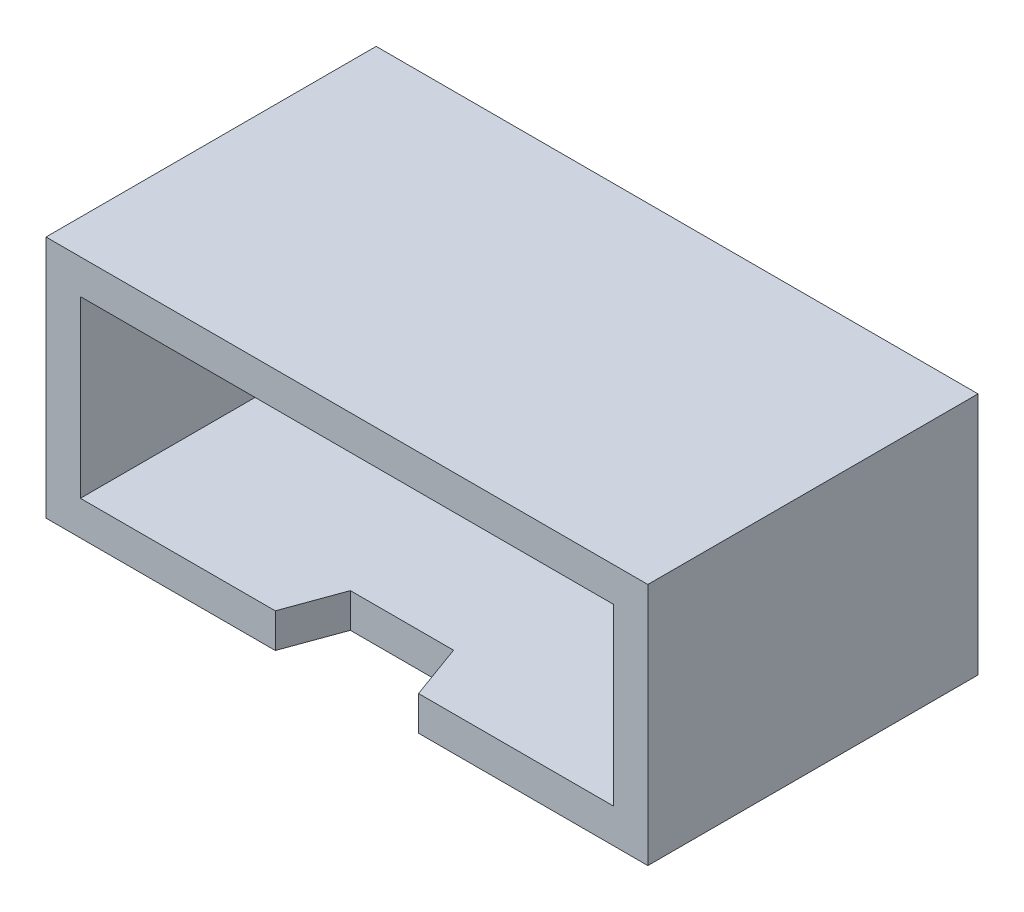
ISO-10303-21;
HEADER;
FILE_DESCRIPTION(('STEP AP214'),'2;1');
FILE_NAME('part.step','',(''),(''),'','','');
FILE_SCHEMA(('AUTOMOTIVE_DESIGN { 1 0 10303 214 1 1 1 1 }'));
ENDSEC;
DATA;
#1=APPLICATION_CONTEXT('core data for automotive mechanical design processes');
#2=APPLICATION_PROTOCOL_DEFINITION('international standard','automotive_design',2000,#1);
#3=PRODUCT_CONTEXT('',#1,'mechanical');
#4=PRODUCT('Part','Part','',(#3));
#5=PRODUCT_RELATED_PRODUCT_CATEGORY('part','',(#4));
#6=PRODUCT_DEFINITION_FORMATION('','',#4);
#7=PRODUCT_DEFINITION_CONTEXT('part definition',#1,'design');
#8=PRODUCT_DEFINITION('design','',#6,#7);
#9=PRODUCT_DEFINITION_SHAPE('','',#8);
#10=(LENGTH_UNIT() NAMED_UNIT(*) SI_UNIT(.MILLI.,.METRE.));
#11=(NAMED_UNIT(*) PLANE_ANGLE_UNIT() SI_UNIT($,.RADIAN.));
#12=(NAMED_UNIT(*) SI_UNIT($,.STERADIAN.) SOLID_ANGLE_UNIT());
#13=UNCERTAINTY_MEASURE_WITH_UNIT(LENGTH_MEASURE(1.E-05),#10,'distance_accuracy_value','');
#14=(GEOMETRIC_REPRESENTATION_CONTEXT(3) GLOBAL_UNCERTAINTY_ASSIGNED_CONTEXT((#13)) GLOBAL_UNIT_ASSIGNED_CONTEXT((#10,
#11,#12)) REPRESENTATION_CONTEXT('',''));
#15=CARTESIAN_POINT('',(0.,0.,0.));
#16=DIRECTION('',(0.,0.,1.));
#17=DIRECTION('',(1.,0.,0.));
#18=AXIS2_PLACEMENT_3D('',#15,#16,#17);
#19=CARTESIAN_POINT('',(7.98,-3.54,8.));
#20=DIRECTION('',(0.,0.,-1.));
#21=DIRECTION('',(-1.,0.,0.));
#22=AXIS2_PLACEMENT_3D('',#19,#20,#21);
#23=PLANE('',#22);
#24=DIRECTION('',(0.,1.,0.));
#25=VECTOR('',#24,1.);
#26=CARTESIAN_POINT('',(4.98,-3.54,8.));
#27=LINE('',#26,#25);
#28=CARTESIAN_POINT('',(4.98,-2.53999998509884,8.));
#29=VERTEX_POINT('',#28);
#30=CARTESIAN_POINT('',(4.98,-3.54,8.));
#31=VERTEX_POINT('',#30);
#32=EDGE_CURVE('E126',#29,#31,#27,.F.);
#33=ORIENTED_EDGE('',*,*,#32,.T.);
#34=DIRECTION('',(1.,0.,0.));
#35=VECTOR('',#34,1.);
#36=CARTESIAN_POINT('',(-2.27,-3.54,8.));
#37=LINE('',#36,#35);
#38=CARTESIAN_POINT('',(7.98,-3.54,8.));
#39=VERTEX_POINT('',#38);
#40=EDGE_CURVE('E136',#39,#31,#37,.F.);
#41=ORIENTED_EDGE('',*,*,#40,.F.);
#42=DIRECTION('',(0.,1.,0.));
#43=VECTOR('',#42,1.);
#44=CARTESIAN_POINT('',(7.98,-3.54,8.));
#45=LINE('',#44,#43);
#46=CARTESIAN_POINT('',(7.98,-2.53999998509884,8.));
#47=VERTEX_POINT('',#46);
#48=EDGE_CURVE('E19',#39,#47,#45,.T.);
#49=ORIENTED_EDGE('',*,*,#48,.T.);
#50=DIRECTION('',(1.,0.,0.));
#51=VECTOR('',#50,1.);
#52=CARTESIAN_POINT('',(14.2299999850988,-2.53999998509884,8.));
#53=LINE('',#52,#51);
#54=EDGE_CURVE('E133',#29,#47,#53,.T.);
#55=ORIENTED_EDGE('',*,*,#54,.F.);
#56=EDGE_LOOP('',(#33,#41,#49,#55));
#57=FACE_BOUND('',#56,.T.);
#58=ADVANCED_FACE('F16',(#57),#23,.F.);
#59=CARTESIAN_POINT('',(8.56235237482626,-3.54,9.6));
#60=DIRECTION('',(0.939692620785844,0.,-0.342020143325846));
#61=DIRECTION('',(-0.342020143325846,0.,-0.939692620785844));
#62=AXIS2_PLACEMENT_3D('',#59,#60,#61);
#63=PLANE('',#62);
#64=ORIENTED_EDGE('',*,*,#48,.F.);
#65=DIRECTION('',(-0.342020143325842,0.,-0.939692620785845));
#66=VECTOR('',#65,1.);
#67=CARTESIAN_POINT('',(8.56235237482626,-3.54,9.6));
#68=LINE('',#67,#66);
#69=CARTESIAN_POINT('',(8.56235237482626,-3.54,9.6));
#70=VERTEX_POINT('',#69);
#71=EDGE_CURVE('E156',#70,#39,#68,.T.);
#72=ORIENTED_EDGE('',*,*,#71,.F.);
#73=DIRECTION('',(0.,1.,0.));
#74=VECTOR('',#73,1.);
#75=CARTESIAN_POINT('',(8.56235237482626,0.,9.6));
#76=LINE('',#75,#74);
#77=CARTESIAN_POINT('',(8.56235237482626,-2.53999998509884,9.6));
#78=VERTEX_POINT('',#77);
#79=EDGE_CURVE('E144',#78,#70,#76,.F.);
#80=ORIENTED_EDGE('',*,*,#79,.F.);
#81=DIRECTION('',(0.342020143325843,0.,0.939692620785845));
#82=VECTOR('',#81,1.);
#83=CARTESIAN_POINT('',(7.98,-2.53999998509884,8.));
#84=LINE('',#83,#82);
#85=EDGE_CURVE('E141',#47,#78,#84,.T.);
#86=ORIENTED_EDGE('',*,*,#85,.F.);
#87=EDGE_LOOP('',(#64,#72,#80,#86));
#88=FACE_BOUND('',#87,.T.);
#89=ADVANCED_FACE('F142',(#88),#63,.F.);
#90=CARTESIAN_POINT('',(4.98,-3.54,8.));
#91=DIRECTION('',(-0.939692620785775,0.,-0.342020143326035));
#92=DIRECTION('',(-0.342020143326035,0.,0.939692620785775));
#93=AXIS2_PLACEMENT_3D('',#90,#91,#92);
#94=PLANE('',#93);
#95=DIRECTION('',(0.,1.,0.));
#96=VECTOR('',#95,1.);
#97=CARTESIAN_POINT('',(4.39764762517337,0.,9.6));
#98=LINE('',#97,#96);
#99=CARTESIAN_POINT('',(4.39764762517337,-3.54,9.6));
#100=VERTEX_POINT('',#99);
#101=CARTESIAN_POINT('',(4.39764762517337,-2.53999998509884,9.6));
#102=VERTEX_POINT('',#101);
#103=EDGE_CURVE('E182',#100,#102,#98,.T.);
#104=ORIENTED_EDGE('',*,*,#103,.F.);
#105=DIRECTION('',(-0.342020143326035,0.,0.939692620785775));
#106=VECTOR('',#105,1.);
#107=CARTESIAN_POINT('',(4.98,-3.54,8.));
#108=LINE('',#107,#106);
#109=EDGE_CURVE('E179',#31,#100,#108,.T.);
#110=ORIENTED_EDGE('',*,*,#109,.F.);
#111=ORIENTED_EDGE('',*,*,#32,.F.);
#112=DIRECTION('',(0.342020143326036,0.,-0.939692620785775));
#113=VECTOR('',#112,1.);
#114=CARTESIAN_POINT('',(4.39764762517337,-2.53999998509884,9.6));
#115=LINE('',#114,#113);
#116=EDGE_CURVE('E154',#102,#29,#115,.T.);
#117=ORIENTED_EDGE('',*,*,#116,.F.);
#118=EDGE_LOOP('',(#104,#110,#111,#117));
#119=FACE_BOUND('',#118,.T.);
#120=ADVANCED_FACE('F180',(#119),#94,.F.);
#121=CARTESIAN_POINT('',(-1.26999998509884,-2.53999998509884,0.));
#122=DIRECTION('',(1.,0.,0.));
#123=DIRECTION('',(0.,1.,0.));
#124=AXIS2_PLACEMENT_3D('',#121,#122,#123);
#125=PLANE('',#124);
#126=DIRECTION('',(0.,1.,0.));
#127=VECTOR('',#126,1.);
#128=CARTESIAN_POINT('',(-1.26999998509884,0.,9.6));
#129=LINE('',#128,#127);
#130=CARTESIAN_POINT('',(-1.26999998509884,-2.53999998509884,9.6));
#131=VERTEX_POINT('',#130);
#132=CARTESIAN_POINT('',(-1.26999998509884,2.53999998509884,9.6));
#133=VERTEX_POINT('',#132);
#134=EDGE_CURVE('E234',#131,#133,#129,.T.);
#135=ORIENTED_EDGE('',*,*,#134,.F.);
#136=DIRECTION('',(0.,0.,1.));
#137=VECTOR('',#136,1.);
#138=CARTESIAN_POINT('',(-1.26999998509884,-2.53999998509884,0.));
#139=LINE('',#138,#137);
#140=CARTESIAN_POINT('',(-1.26999998509884,-2.53999998509884,0.));
#141=VERTEX_POINT('',#140);
#142=EDGE_CURVE('E162',#141,#131,#139,.T.);
#143=ORIENTED_EDGE('',*,*,#142,.F.);
#144=DIRECTION('',(0.,1.,0.));
#145=VECTOR('',#144,1.);
#146=CARTESIAN_POINT('',(-1.26999998509884,0.,0.));
#147=LINE('',#146,#145);
#148=CARTESIAN_POINT('',(-1.26999998509884,2.53999998509884,0.));
#149=VERTEX_POINT('',#148);
#150=EDGE_CURVE('E203',#141,#149,#147,.T.);
#151=ORIENTED_EDGE('',*,*,#150,.T.);
#152=DIRECTION('',(0.,0.,-1.));
#153=VECTOR('',#152,1.);
#154=CARTESIAN_POINT('',(-1.26999998509884,2.53999998509884,0.));
#155=LINE('',#154,#153);
#156=EDGE_CURVE('E173',#133,#149,#155,.T.);
#157=ORIENTED_EDGE('',*,*,#156,.F.);
#158=EDGE_LOOP('',(#135,#143,#151,#157));
#159=FACE_BOUND('',#158,.T.);
#160=ADVANCED_FACE('F306',(#159),#125,.T.);
#161=CARTESIAN_POINT('',(-1.26999998509884,2.53999998509884,0.));
#162=DIRECTION('',(0.,-1.,0.));
#163=DIRECTION('',(0.,0.,-1.));
#164=AXIS2_PLACEMENT_3D('',#161,#162,#163);
#165=PLANE('',#164);
#166=DIRECTION('',(1.,0.,0.));
#167=VECTOR('',#166,1.);
#168=CARTESIAN_POINT('',(6.48,2.53999998509884,9.6));
#169=LINE('',#168,#167);
#170=CARTESIAN_POINT('',(14.2299999850988,2.53999998509884,9.6));
#171=VERTEX_POINT('',#170);
#172=EDGE_CURVE('E238',#133,#171,#169,.T.);
#173=ORIENTED_EDGE('',*,*,#172,.F.);
#174=ORIENTED_EDGE('',*,*,#156,.T.);
#175=DIRECTION('',(1.,0.,0.));
#176=VECTOR('',#175,1.);
#177=CARTESIAN_POINT('',(6.48,2.53999998509884,0.));
#178=LINE('',#177,#176);
#179=CARTESIAN_POINT('',(14.2299999850988,2.53999998509884,0.));
#180=VERTEX_POINT('',#179);
#181=EDGE_CURVE('E206',#149,#180,#178,.T.);
#182=ORIENTED_EDGE('',*,*,#181,.T.);
#183=DIRECTION('',(0.,0.,1.));
#184=VECTOR('',#183,1.);
#185=CARTESIAN_POINT('',(14.2299999850988,2.53999998509884,0.));
#186=LINE('',#185,#184);
#187=EDGE_CURVE('E150',#171,#180,#186,.F.);
#188=ORIENTED_EDGE('',*,*,#187,.F.);
#189=EDGE_LOOP('',(#173,#174,#182,#188));
#190=FACE_BOUND('',#189,.T.);
#191=ADVANCED_FACE('F302',(#190),#165,.T.);
#192=CARTESIAN_POINT('',(14.2299999850988,2.53999998509884,0.));
#193=DIRECTION('',(-1.,0.,0.));
#194=DIRECTION('',(0.,0.,1.));
#195=AXIS2_PLACEMENT_3D('',#192,#193,#194);
#196=PLANE('',#195);
#197=DIRECTION('',(0.,1.,0.));
#198=VECTOR('',#197,1.);
#199=CARTESIAN_POINT('',(14.2299999850988,0.,9.6));
#200=LINE('',#199,#198);
#201=CARTESIAN_POINT('',(14.2299999850988,-2.53999998509884,9.6));
#202=VERTEX_POINT('',#201);
#203=EDGE_CURVE('E242',#171,#202,#200,.F.);
#204=ORIENTED_EDGE('',*,*,#203,.F.);
#205=ORIENTED_EDGE('',*,*,#187,.T.);
#206=DIRECTION('',(0.,1.,0.));
#207=VECTOR('',#206,1.);
#208=CARTESIAN_POINT('',(14.2299999850988,0.,0.));
#209=LINE('',#208,#207);
#210=CARTESIAN_POINT('',(14.2299999850988,-2.53999998509884,0.));
#211=VERTEX_POINT('',#210);
#212=EDGE_CURVE('E196',#180,#211,#209,.F.);
#213=ORIENTED_EDGE('',*,*,#212,.T.);
#214=DIRECTION('',(0.,0.,1.));
#215=VECTOR('',#214,1.);
#216=CARTESIAN_POINT('',(14.2299999850988,-2.53999998509884,0.));
#217=LINE('',#216,#215);
#218=EDGE_CURVE('E149',#202,#211,#217,.F.);
#219=ORIENTED_EDGE('',*,*,#218,.F.);
#220=EDGE_LOOP('',(#204,#205,#213,#219));
#221=FACE_BOUND('',#220,.T.);
#222=ADVANCED_FACE('F300',(#221),#196,.T.);
#223=CARTESIAN_POINT('',(14.2299999850988,-2.53999998509884,0.));
#224=DIRECTION('',(0.,1.,0.));
#225=DIRECTION('',(0.,0.,1.));
#226=AXIS2_PLACEMENT_3D('',#223,#224,#225);
#227=PLANE('',#226);
#228=ORIENTED_EDGE('',*,*,#116,.T.);
#229=ORIENTED_EDGE('',*,*,#54,.T.);
#230=ORIENTED_EDGE('',*,*,#85,.T.);
#231=DIRECTION('',(1.,0.,0.));
#232=VECTOR('',#231,1.);
#233=CARTESIAN_POINT('',(6.48,-2.53999998509884,9.6));
#234=LINE('',#233,#232);
#235=EDGE_CURVE('E246',#202,#78,#234,.F.);
#236=ORIENTED_EDGE('',*,*,#235,.F.);
#237=ORIENTED_EDGE('',*,*,#218,.T.);
#238=DIRECTION('',(1.,0.,0.));
#239=VECTOR('',#238,1.);
#240=CARTESIAN_POINT('',(6.48,-2.53999998509884,0.));
#241=LINE('',#240,#239);
#242=EDGE_CURVE('E199',#211,#141,#241,.F.);
#243=ORIENTED_EDGE('',*,*,#242,.T.);
#244=ORIENTED_EDGE('',*,*,#142,.T.);
#245=DIRECTION('',(1.,0.,0.));
#246=VECTOR('',#245,1.);
#247=CARTESIAN_POINT('',(6.48,-2.53999998509884,9.6));
#248=LINE('',#247,#246);
#249=EDGE_CURVE('E230',#102,#131,#248,.F.);
#250=ORIENTED_EDGE('',*,*,#249,.F.);
#251=EDGE_LOOP('',(#228,#229,#230,#236,#237,#243,#244,#250));
#252=FACE_BOUND('',#251,.T.);
#253=ADVANCED_FACE('F152',(#252),#227,.T.);
#254=CARTESIAN_POINT('',(-2.27,-3.54,0.));
#255=DIRECTION('',(0.,-1.,0.));
#256=DIRECTION('',(0.,0.,-1.));
#257=AXIS2_PLACEMENT_3D('',#254,#255,#256);
#258=PLANE('',#257);
#259=DIRECTION('',(0.,0.,-1.));
#260=VECTOR('',#259,1.);
#261=CARTESIAN_POINT('',(15.23,-3.54,0.));
#262=LINE('',#261,#260);
#263=CARTESIAN_POINT('',(15.23,-3.54,9.6));
#264=VERTEX_POINT('',#263);
#265=CARTESIAN_POINT('',(15.23,-3.54,0.));
#266=VERTEX_POINT('',#265);
#267=EDGE_CURVE('E255',#264,#266,#262,.T.);
#268=ORIENTED_EDGE('',*,*,#267,.F.);
#269=DIRECTION('',(1.,0.,0.));
#270=VECTOR('',#269,1.);
#271=CARTESIAN_POINT('',(6.48,-3.54,9.6));
#272=LINE('',#271,#270);
#273=EDGE_CURVE('E219',#70,#264,#272,.T.);
#274=ORIENTED_EDGE('',*,*,#273,.F.);
#275=ORIENTED_EDGE('',*,*,#71,.T.);
#276=ORIENTED_EDGE('',*,*,#40,.T.);
#277=ORIENTED_EDGE('',*,*,#109,.T.);
#278=DIRECTION('',(1.,0.,0.));
#279=VECTOR('',#278,1.);
#280=CARTESIAN_POINT('',(6.48,-3.54,9.6));
#281=LINE('',#280,#279);
#282=CARTESIAN_POINT('',(-2.27,-3.54,9.6));
#283=VERTEX_POINT('',#282);
#284=EDGE_CURVE('E226',#283,#100,#281,.T.);
#285=ORIENTED_EDGE('',*,*,#284,.F.);
#286=DIRECTION('',(0.,0.,1.));
#287=VECTOR('',#286,1.);
#288=CARTESIAN_POINT('',(-2.27,-3.54,0.));
#289=LINE('',#288,#287);
#290=CARTESIAN_POINT('',(-2.27,-3.54,0.));
#291=VERTEX_POINT('',#290);
#292=EDGE_CURVE('E214',#291,#283,#289,.T.);
#293=ORIENTED_EDGE('',*,*,#292,.F.);
#294=DIRECTION('',(1.,0.,0.));
#295=VECTOR('',#294,1.);
#296=CARTESIAN_POINT('',(6.48,-3.54,0.));
#297=LINE('',#296,#295);
#298=EDGE_CURVE('E187',#291,#266,#297,.T.);
#299=ORIENTED_EDGE('',*,*,#298,.T.);
#300=EDGE_LOOP('',(#268,#274,#275,#276,#277,#285,#293,#299));
#301=FACE_BOUND('',#300,.T.);
#302=ADVANCED_FACE('F190',(#301),#258,.T.);
#303=CARTESIAN_POINT('',(6.48,0.,0.));
#304=DIRECTION('',(0.,0.,1.));
#305=DIRECTION('',(1.,0.,0.));
#306=AXIS2_PLACEMENT_3D('',#303,#304,#305);
#307=PLANE('',#306);
#308=ORIENTED_EDGE('',*,*,#150,.F.);
#309=ORIENTED_EDGE('',*,*,#242,.F.);
#310=ORIENTED_EDGE('',*,*,#212,.F.);
#311=ORIENTED_EDGE('',*,*,#181,.F.);
#312=EDGE_LOOP('',(#308,#309,#310,#311));
#313=FACE_BOUND('',#312,.T.);
#314=DIRECTION('',(0.,1.,0.));
#315=VECTOR('',#314,1.);
#316=CARTESIAN_POINT('',(-2.27,3.54,0.));
#317=LINE('',#316,#315);
#318=CARTESIAN_POINT('',(-2.27,3.54,0.));
#319=VERTEX_POINT('',#318);
#320=EDGE_CURVE('E210',#319,#291,#317,.F.);
#321=ORIENTED_EDGE('',*,*,#320,.F.);
#322=DIRECTION('',(1.,0.,0.));
#323=VECTOR('',#322,1.);
#324=CARTESIAN_POINT('',(15.23,3.54,0.));
#325=LINE('',#324,#323);
#326=CARTESIAN_POINT('',(15.23,3.54,0.));
#327=VERTEX_POINT('',#326);
#328=EDGE_CURVE('E259',#327,#319,#325,.F.);
#329=ORIENTED_EDGE('',*,*,#328,.F.);
#330=DIRECTION('',(0.,1.,0.));
#331=VECTOR('',#330,1.);
#332=CARTESIAN_POINT('',(15.23,-3.54,0.));
#333=LINE('',#332,#331);
#334=EDGE_CURVE('E249',#266,#327,#333,.T.);
#335=ORIENTED_EDGE('',*,*,#334,.F.);
#336=ORIENTED_EDGE('',*,*,#298,.F.);
#337=EDGE_LOOP('',(#321,#329,#335,#336));
#338=FACE_BOUND('',#337,.T.);
#339=ADVANCED_FACE('F278',(#313,#338),#307,.F.);
#340=CARTESIAN_POINT('',(-2.27,3.54,0.));
#341=DIRECTION('',(-1.,0.,0.));
#342=DIRECTION('',(0.,0.,1.));
#343=AXIS2_PLACEMENT_3D('',#340,#341,#342);
#344=PLANE('',#343);
#345=DIRECTION('',(0.,1.,0.));
#346=VECTOR('',#345,1.);
#347=CARTESIAN_POINT('',(-2.27,0.,9.6));
#348=LINE('',#347,#346);
#349=CARTESIAN_POINT('',(-2.27,3.54,9.6));
#350=VERTEX_POINT('',#349);
#351=EDGE_CURVE('E222',#350,#283,#348,.F.);
#352=ORIENTED_EDGE('',*,*,#351,.F.);
#353=DIRECTION('',(0.,0.,1.));
#354=VECTOR('',#353,1.);
#355=CARTESIAN_POINT('',(-2.27,3.54,0.));
#356=LINE('',#355,#354);
#357=EDGE_CURVE('E263',#319,#350,#356,.T.);
#358=ORIENTED_EDGE('',*,*,#357,.F.);
#359=ORIENTED_EDGE('',*,*,#320,.T.);
#360=ORIENTED_EDGE('',*,*,#292,.T.);
#361=EDGE_LOOP('',(#352,#358,#359,#360));
#362=FACE_BOUND('',#361,.T.);
#363=ADVANCED_FACE('F274',(#362),#344,.T.);
#364=CARTESIAN_POINT('',(6.48,0.,9.6));
#365=DIRECTION('',(0.,0.,1.));
#366=DIRECTION('',(1.,0.,0.));
#367=AXIS2_PLACEMENT_3D('',#364,#365,#366);
#368=PLANE('',#367);
#369=ORIENTED_EDGE('',*,*,#203,.T.);
#370=ORIENTED_EDGE('',*,*,#235,.T.);
#371=ORIENTED_EDGE('',*,*,#79,.T.);
#372=ORIENTED_EDGE('',*,*,#273,.T.);
#373=DIRECTION('',(0.,1.,0.));
#374=VECTOR('',#373,1.);
#375=CARTESIAN_POINT('',(15.23,-3.54,9.6));
#376=LINE('',#375,#374);
#377=CARTESIAN_POINT('',(15.23,3.54,9.6));
#378=VERTEX_POINT('',#377);
#379=EDGE_CURVE('E39',#378,#264,#376,.F.);
#380=ORIENTED_EDGE('',*,*,#379,.F.);
#381=DIRECTION('',(1.,0.,0.));
#382=VECTOR('',#381,1.);
#383=CARTESIAN_POINT('',(15.23,3.54,9.6));
#384=LINE('',#383,#382);
#385=EDGE_CURVE('E26',#350,#378,#384,.T.);
#386=ORIENTED_EDGE('',*,*,#385,.F.);
#387=ORIENTED_EDGE('',*,*,#351,.T.);
#388=ORIENTED_EDGE('',*,*,#284,.T.);
#389=ORIENTED_EDGE('',*,*,#103,.T.);
#390=ORIENTED_EDGE('',*,*,#249,.T.);
#391=ORIENTED_EDGE('',*,*,#134,.T.);
#392=ORIENTED_EDGE('',*,*,#172,.T.);
#393=EDGE_LOOP('',(#369,#370,#371,#372,#380,#386,#387,#388,#389,#390,#391,#392));
#394=FACE_BOUND('',#393,.T.);
#395=ADVANCED_FACE('F272',(#394),#368,.T.);
#396=CARTESIAN_POINT('',(15.23,-3.54,0.));
#397=DIRECTION('',(1.,0.,0.));
#398=DIRECTION('',(0.,0.,-1.));
#399=AXIS2_PLACEMENT_3D('',#396,#397,#398);
#400=PLANE('',#399);
#401=ORIENTED_EDGE('',*,*,#379,.T.);
#402=ORIENTED_EDGE('',*,*,#267,.T.);
#403=ORIENTED_EDGE('',*,*,#334,.T.);
#404=DIRECTION('',(0.,0.,1.));
#405=VECTOR('',#404,1.);
#406=CARTESIAN_POINT('',(15.23,3.54,0.));
#407=LINE('',#406,#405);
#408=EDGE_CURVE('E11',#378,#327,#407,.F.);
#409=ORIENTED_EDGE('',*,*,#408,.F.);
#410=EDGE_LOOP('',(#401,#402,#403,#409));
#411=FACE_BOUND('',#410,.T.);
#412=ADVANCED_FACE('F280',(#411),#400,.T.);
#413=CARTESIAN_POINT('',(15.23,3.54,0.));
#414=DIRECTION('',(0.,1.,0.));
#415=DIRECTION('',(0.,0.,1.));
#416=AXIS2_PLACEMENT_3D('',#413,#414,#415);
#417=PLANE('',#416);
#418=ORIENTED_EDGE('',*,*,#385,.T.);
#419=ORIENTED_EDGE('',*,*,#408,.T.);
#420=ORIENTED_EDGE('',*,*,#328,.T.);
#421=ORIENTED_EDGE('',*,*,#357,.T.);
#422=EDGE_LOOP('',(#418,#419,#420,#421));
#423=FACE_BOUND('',#422,.T.);
#424=ADVANCED_FACE('F270',(#423),#417,.T.);
#425=CLOSED_SHELL('',(#58,#89,#120,#160,#191,#222,#253,#302,#339,#363,#395,#412,#424));
#426=MANIFOLD_SOLID_BREP('B1',#425);
#427=ADVANCED_BREP_SHAPE_REPRESENTATION('',(#18,#426),#14);
#428=SHAPE_DEFINITION_REPRESENTATION(#9,#427);
ENDSEC;
END-ISO-10303-21;
